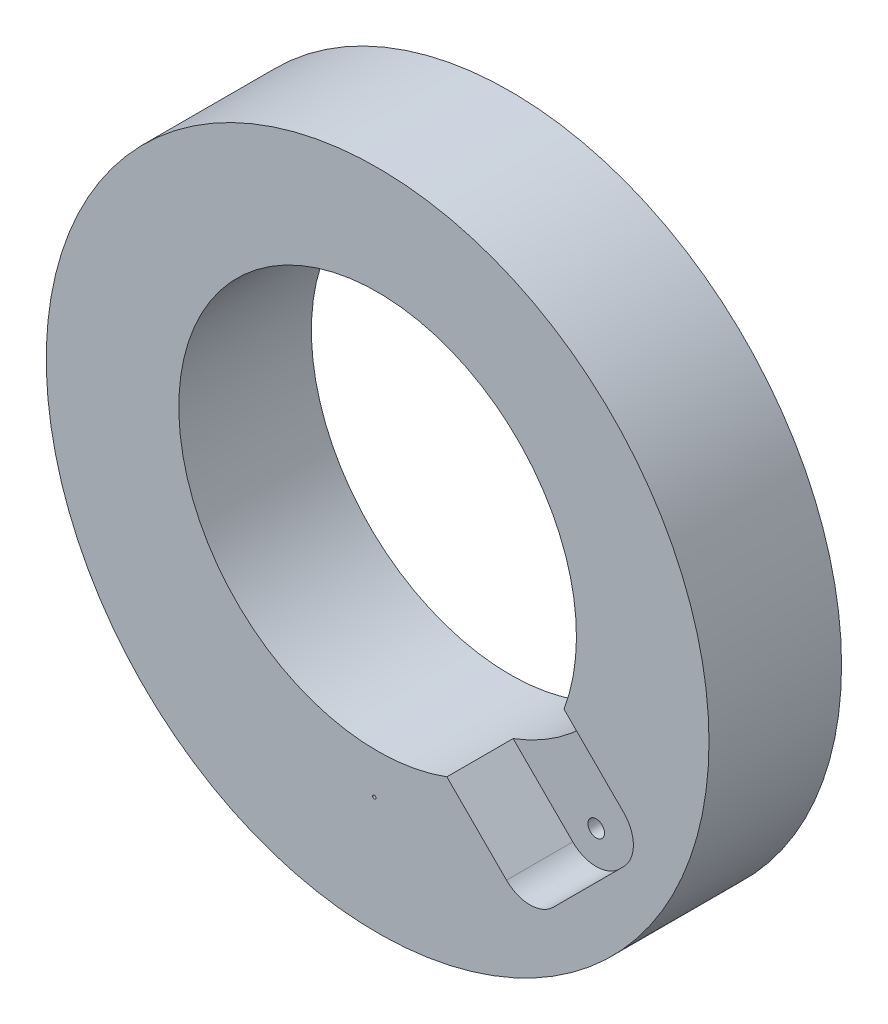
ISO-10303-21;
HEADER;
FILE_DESCRIPTION(('STEP AP214'),'2;1');
FILE_NAME('part.step','',(''),(''),'','','');
FILE_SCHEMA(('AUTOMOTIVE_DESIGN { 1 0 10303 214 1 1 1 1 }'));
ENDSEC;
DATA;
#1=APPLICATION_CONTEXT('core data for automotive mechanical design processes');
#2=APPLICATION_PROTOCOL_DEFINITION('international standard','automotive_design',2000,#1);
#3=PRODUCT_CONTEXT('',#1,'mechanical');
#4=PRODUCT('Part','Part','',(#3));
#5=PRODUCT_RELATED_PRODUCT_CATEGORY('part','',(#4));
#6=PRODUCT_DEFINITION_FORMATION('','',#4);
#7=PRODUCT_DEFINITION_CONTEXT('part definition',#1,'design');
#8=PRODUCT_DEFINITION('design','',#6,#7);
#9=PRODUCT_DEFINITION_SHAPE('','',#8);
#10=(LENGTH_UNIT() NAMED_UNIT(*) SI_UNIT(.MILLI.,.METRE.));
#11=(NAMED_UNIT(*) PLANE_ANGLE_UNIT() SI_UNIT($,.RADIAN.));
#12=(NAMED_UNIT(*) SI_UNIT($,.STERADIAN.) SOLID_ANGLE_UNIT());
#13=UNCERTAINTY_MEASURE_WITH_UNIT(LENGTH_MEASURE(1.E-05),#10,'distance_accuracy_value','');
#14=(GEOMETRIC_REPRESENTATION_CONTEXT(3) GLOBAL_UNCERTAINTY_ASSIGNED_CONTEXT((#13)) GLOBAL_UNIT_ASSIGNED_CONTEXT((#10,
#11,#12)) REPRESENTATION_CONTEXT('',''));
#15=CARTESIAN_POINT('',(0.,0.,0.));
#16=DIRECTION('',(0.,0.,1.));
#17=DIRECTION('',(1.,0.,0.));
#18=AXIS2_PLACEMENT_3D('',#15,#16,#17);
#19=CARTESIAN_POINT('',(0.,0.,40.));
#20=DIRECTION('',(0.,0.,1.));
#21=DIRECTION('',(1.,0.,0.));
#22=AXIS2_PLACEMENT_3D('',#19,#20,#21);
#23=PLANE('',#22);
#24=CARTESIAN_POINT('',(-0.999999999999994,-64.9923072370877,40.));
#25=DIRECTION('',(0.,0.,1.));
#26=DIRECTION('',(1.,0.,0.));
#27=AXIS2_PLACEMENT_3D('',#24,#25,#26);
#28=CIRCLE('',#27,0.499999999999999);
#29=CARTESIAN_POINT('',(-0.499999999999995,-64.9923072370877,40.));
#30=VERTEX_POINT('',#29);
#31=EDGE_CURVE('E106',#30,#30,#28,.T.);
#32=ORIENTED_EDGE('',*,*,#31,.F.);
#33=EDGE_LOOP('',(#32));
#34=FACE_BOUND('',#33,.T.);
#35=DIRECTION('',(0.707106781186544,-0.707106781186551,0.));
#36=VECTOR('',#35,1.);
#37=CARTESIAN_POINT('',(17.272249399292,-45.1275884586198,40.));
#38=LINE('',#37,#36);
#39=CARTESIAN_POINT('',(20.8904520216898,-48.7457910810176,40.));
#40=VERTEX_POINT('',#39);
#41=CARTESIAN_POINT('',(38.8908729652597,-66.7462120245877,40.));
#42=VERTEX_POINT('',#41);
#43=EDGE_CURVE('E117',#40,#42,#38,.T.);
#44=ORIENTED_EDGE('',*,*,#43,.F.);
#45=CARTESIAN_POINT('',(0.,7.5,40.));
#46=DIRECTION('',(0.,0.,1.));
#47=DIRECTION('',(1.,0.,0.));
#48=AXIS2_PLACEMENT_3D('',#45,#46,#47);
#49=CIRCLE('',#48,60.);
#50=CARTESIAN_POINT('',(56.2457910810174,-13.3904520216904,40.));
#51=VERTEX_POINT('',#50);
#52=EDGE_CURVE('E128',#51,#40,#49,.T.);
#53=ORIENTED_EDGE('',*,*,#52,.F.);
#54=DIRECTION('',(-0.707106781186544,0.707106781186551,0.));
#55=VECTOR('',#54,1.);
#56=CARTESIAN_POINT('',(52.6275884586196,-9.7722493992926,40.));
#57=LINE('',#56,#55);
#58=CARTESIAN_POINT('',(74.2462120245873,-31.3908729652605,40.));
#59=VERTEX_POINT('',#58);
#60=EDGE_CURVE('E114',#59,#51,#57,.T.);
#61=ORIENTED_EDGE('',*,*,#60,.F.);
#62=CARTESIAN_POINT('',(67.1751442127218,-38.4619407771259,40.));
#63=DIRECTION('',(0.,0.,1.));
#64=DIRECTION('',(-1.,0.,0.));
#65=AXIS2_PLACEMENT_3D('',#62,#63,#64);
#66=CIRCLE('',#65,10.);
#67=CARTESIAN_POINT('',(74.2462120245872,-45.5330085889914,40.));
#68=VERTEX_POINT('',#67);
#69=EDGE_CURVE('E87',#68,#59,#66,.T.);
#70=ORIENTED_EDGE('',*,*,#69,.F.);
#71=DIRECTION('',(0.707106781186551,0.707106781186544,0.));
#72=VECTOR('',#71,1.);
#73=CARTESIAN_POINT('',(53.0330085889907,-66.7462120245878,40.));
#74=LINE('',#73,#72);
#75=CARTESIAN_POINT('',(53.0330085889907,-66.7462120245878,40.));
#76=VERTEX_POINT('',#75);
#77=EDGE_CURVE('E100',#76,#68,#74,.T.);
#78=ORIENTED_EDGE('',*,*,#77,.F.);
#79=CARTESIAN_POINT('',(45.9619407771252,-59.6751442127223,40.));
#80=DIRECTION('',(0.,0.,1.));
#81=DIRECTION('',(1.,0.,0.));
#82=AXIS2_PLACEMENT_3D('',#79,#80,#81);
#83=CIRCLE('',#82,9.99999999999999);
#84=EDGE_CURVE('E103',#42,#76,#83,.T.);
#85=ORIENTED_EDGE('',*,*,#84,.F.);
#86=EDGE_LOOP('',(#44,#53,#61,#70,#78,#85));
#87=FACE_BOUND('',#86,.T.);
#88=CARTESIAN_POINT('',(0.,0.,40.));
#89=DIRECTION('',(0.,0.,1.));
#90=DIRECTION('',(1.,0.,0.));
#91=AXIS2_PLACEMENT_3D('',#88,#89,#90);
#92=CIRCLE('',#91,100.);
#93=CARTESIAN_POINT('',(100.,0.,40.));
#94=VERTEX_POINT('',#93);
#95=EDGE_CURVE('E134',#94,#94,#92,.T.);
#96=ORIENTED_EDGE('',*,*,#95,.T.);
#97=EDGE_LOOP('',(#96));
#98=FACE_BOUND('',#97,.T.);
#99=ADVANCED_FACE('F30',(#34,#87,#98),#23,.T.);
#100=CARTESIAN_POINT('',(0.,0.,0.));
#101=DIRECTION('',(0.,0.,1.));
#102=DIRECTION('',(1.,0.,0.));
#103=AXIS2_PLACEMENT_3D('',#100,#101,#102);
#104=PLANE('',#103);
#105=CARTESIAN_POINT('',(45.9619407771252,-59.6751442127223,0.));
#106=DIRECTION('',(0.,0.,1.));
#107=DIRECTION('',(1.,0.,0.));
#108=AXIS2_PLACEMENT_3D('',#105,#106,#107);
#109=CIRCLE('',#108,2.5);
#110=CARTESIAN_POINT('',(48.4619407771252,-59.6751442127223,0.));
#111=VERTEX_POINT('',#110);
#112=EDGE_CURVE('E217',#111,#111,#109,.T.);
#113=ORIENTED_EDGE('',*,*,#112,.T.);
#114=EDGE_LOOP('',(#113));
#115=FACE_BOUND('',#114,.T.);
#116=CARTESIAN_POINT('',(67.1751442127218,-38.4619407771259,0.));
#117=DIRECTION('',(0.,0.,1.));
#118=DIRECTION('',(1.,0.,0.));
#119=AXIS2_PLACEMENT_3D('',#116,#117,#118);
#120=CIRCLE('',#119,2.5);
#121=CARTESIAN_POINT('',(69.6751442127218,-38.4619407771259,0.));
#122=VERTEX_POINT('',#121);
#123=EDGE_CURVE('E220',#122,#122,#120,.T.);
#124=ORIENTED_EDGE('',*,*,#123,.T.);
#125=EDGE_LOOP('',(#124));
#126=FACE_BOUND('',#125,.T.);
#127=CARTESIAN_POINT('',(-0.999999999999994,-64.9923072370877,0.));
#128=DIRECTION('',(0.,0.,1.));
#129=DIRECTION('',(1.,0.,0.));
#130=AXIS2_PLACEMENT_3D('',#127,#128,#129);
#131=CIRCLE('',#130,0.499999999999999);
#132=CARTESIAN_POINT('',(-0.499999999999995,-64.9923072370877,0.));
#133=VERTEX_POINT('',#132);
#134=EDGE_CURVE('E115',#133,#133,#131,.T.);
#135=ORIENTED_EDGE('',*,*,#134,.T.);
#136=EDGE_LOOP('',(#135));
#137=FACE_BOUND('',#136,.T.);
#138=CARTESIAN_POINT('',(0.,0.,0.));
#139=DIRECTION('',(0.,0.,1.));
#140=DIRECTION('',(1.,0.,0.));
#141=AXIS2_PLACEMENT_3D('',#138,#139,#140);
#142=CIRCLE('',#141,100.);
#143=CARTESIAN_POINT('',(100.,0.,0.));
#144=VERTEX_POINT('',#143);
#145=EDGE_CURVE('E131',#144,#144,#142,.T.);
#146=ORIENTED_EDGE('',*,*,#145,.F.);
#147=EDGE_LOOP('',(#146));
#148=FACE_BOUND('',#147,.T.);
#149=CARTESIAN_POINT('',(0.,7.5,0.));
#150=DIRECTION('',(0.,0.,1.));
#151=DIRECTION('',(1.,0.,0.));
#152=AXIS2_PLACEMENT_3D('',#149,#150,#151);
#153=CIRCLE('',#152,60.);
#154=CARTESIAN_POINT('',(60.,7.5,0.));
#155=VERTEX_POINT('',#154);
#156=EDGE_CURVE('E123',#155,#155,#153,.T.);
#157=ORIENTED_EDGE('',*,*,#156,.T.);
#158=EDGE_LOOP('',(#157));
#159=FACE_BOUND('',#158,.T.);
#160=ADVANCED_FACE('F142',(#115,#126,#137,#148,#159),#104,.F.);
#161=CARTESIAN_POINT('',(0.,0.,40.));
#162=DIRECTION('',(0.,0.,-1.));
#163=DIRECTION('',(-1.,0.,0.));
#164=AXIS2_PLACEMENT_3D('',#161,#162,#163);
#165=CYLINDRICAL_SURFACE('',#164,100.);
#166=ORIENTED_EDGE('',*,*,#95,.F.);
#167=EDGE_LOOP('',(#166));
#168=FACE_BOUND('',#167,.T.);
#169=ORIENTED_EDGE('',*,*,#145,.T.);
#170=EDGE_LOOP('',(#169));
#171=FACE_BOUND('',#170,.T.);
#172=ADVANCED_FACE('F32',(#168,#171),#165,.T.);
#173=CARTESIAN_POINT('',(0.,7.5,40.));
#174=DIRECTION('',(0.,0.,-1.));
#175=DIRECTION('',(-1.,0.,0.));
#176=AXIS2_PLACEMENT_3D('',#173,#174,#175);
#177=CYLINDRICAL_SURFACE('',#176,60.);
#178=DIRECTION('',(0.,0.,-1.));
#179=VECTOR('',#178,1.);
#180=CARTESIAN_POINT('',(20.8904520216898,-48.7457910810176,40.));
#181=LINE('',#180,#179);
#182=CARTESIAN_POINT('',(20.8904520216898,-48.7457910810176,20.));
#183=VERTEX_POINT('',#182);
#184=EDGE_CURVE('E11',#183,#40,#181,.F.);
#185=ORIENTED_EDGE('',*,*,#184,.F.);
#186=CARTESIAN_POINT('',(0.,7.5,20.));
#187=DIRECTION('',(0.,0.,-1.));
#188=DIRECTION('',(-1.,0.,0.));
#189=AXIS2_PLACEMENT_3D('',#186,#187,#188);
#190=CIRCLE('',#189,60.);
#191=CARTESIAN_POINT('',(56.2457910810174,-13.3904520216904,20.));
#192=VERTEX_POINT('',#191);
#193=EDGE_CURVE('E50',#192,#183,#190,.T.);
#194=ORIENTED_EDGE('',*,*,#193,.F.);
#195=DIRECTION('',(0.,0.,-1.));
#196=VECTOR('',#195,1.);
#197=CARTESIAN_POINT('',(56.2457910810174,-13.3904520216904,40.));
#198=LINE('',#197,#196);
#199=EDGE_CURVE('E38',#51,#192,#198,.T.);
#200=ORIENTED_EDGE('',*,*,#199,.F.);
#201=ORIENTED_EDGE('',*,*,#52,.T.);
#202=EDGE_LOOP('',(#185,#194,#200,#201));
#203=FACE_BOUND('',#202,.T.);
#204=ORIENTED_EDGE('',*,*,#156,.F.);
#205=EDGE_LOOP('',(#204));
#206=FACE_BOUND('',#205,.T.);
#207=ADVANCED_FACE('F148',(#203,#206),#177,.F.);
#208=CARTESIAN_POINT('',(67.1751442127218,-38.4619407771259,20.));
#209=DIRECTION('',(0.,0.,1.));
#210=DIRECTION('',(1.,0.,0.));
#211=AXIS2_PLACEMENT_3D('',#208,#209,#210);
#212=CYLINDRICAL_SURFACE('',#211,10.);
#213=ORIENTED_EDGE('',*,*,#69,.T.);
#214=DIRECTION('',(0.,0.,1.));
#215=VECTOR('',#214,1.);
#216=CARTESIAN_POINT('',(74.2462120245873,-31.3908729652605,20.));
#217=LINE('',#216,#215);
#218=CARTESIAN_POINT('',(74.2462120245873,-31.3908729652605,20.));
#219=VERTEX_POINT('',#218);
#220=EDGE_CURVE('E82',#219,#59,#217,.T.);
#221=ORIENTED_EDGE('',*,*,#220,.F.);
#222=CARTESIAN_POINT('',(67.1751442127218,-38.4619407771259,20.));
#223=DIRECTION('',(0.,0.,1.));
#224=DIRECTION('',(-1.,0.,0.));
#225=AXIS2_PLACEMENT_3D('',#222,#223,#224);
#226=CIRCLE('',#225,10.);
#227=CARTESIAN_POINT('',(74.2462120245872,-45.5330085889914,20.));
#228=VERTEX_POINT('',#227);
#229=EDGE_CURVE('E84',#228,#219,#226,.T.);
#230=ORIENTED_EDGE('',*,*,#229,.F.);
#231=DIRECTION('',(0.,0.,1.));
#232=VECTOR('',#231,1.);
#233=CARTESIAN_POINT('',(74.2462120245872,-45.5330085889914,20.));
#234=LINE('',#233,#232);
#235=EDGE_CURVE('E121',#228,#68,#234,.T.);
#236=ORIENTED_EDGE('',*,*,#235,.T.);
#237=EDGE_LOOP('',(#213,#221,#230,#236));
#238=FACE_BOUND('',#237,.T.);
#239=ADVANCED_FACE('F83',(#238),#212,.F.);
#240=CARTESIAN_POINT('',(53.0330085889907,-66.7462120245878,20.));
#241=DIRECTION('',(0.707106781186544,-0.707106781186551,0.));
#242=DIRECTION('',(0.707106781186551,0.707106781186544,0.));
#243=AXIS2_PLACEMENT_3D('',#240,#241,#242);
#244=PLANE('',#243);
#245=ORIENTED_EDGE('',*,*,#77,.T.);
#246=ORIENTED_EDGE('',*,*,#235,.F.);
#247=DIRECTION('',(0.707106781186551,0.707106781186544,0.));
#248=VECTOR('',#247,1.);
#249=CARTESIAN_POINT('',(53.0330085889907,-66.7462120245878,20.));
#250=LINE('',#249,#248);
#251=CARTESIAN_POINT('',(53.0330085889907,-66.7462120245878,20.));
#252=VERTEX_POINT('',#251);
#253=EDGE_CURVE('E91',#252,#228,#250,.T.);
#254=ORIENTED_EDGE('',*,*,#253,.F.);
#255=DIRECTION('',(0.,0.,1.));
#256=VECTOR('',#255,1.);
#257=CARTESIAN_POINT('',(53.0330085889907,-66.7462120245878,20.));
#258=LINE('',#257,#256);
#259=EDGE_CURVE('E124',#252,#76,#258,.T.);
#260=ORIENTED_EDGE('',*,*,#259,.T.);
#261=EDGE_LOOP('',(#245,#246,#254,#260));
#262=FACE_BOUND('',#261,.T.);
#263=ADVANCED_FACE('F156',(#262),#244,.F.);
#264=CARTESIAN_POINT('',(45.9619407771252,-59.6751442127223,20.));
#265=DIRECTION('',(0.,0.,1.));
#266=DIRECTION('',(1.,0.,0.));
#267=AXIS2_PLACEMENT_3D('',#264,#265,#266);
#268=CYLINDRICAL_SURFACE('',#267,9.99999999999999);
#269=ORIENTED_EDGE('',*,*,#84,.T.);
#270=ORIENTED_EDGE('',*,*,#259,.F.);
#271=CARTESIAN_POINT('',(45.9619407771252,-59.6751442127223,20.));
#272=DIRECTION('',(0.,0.,1.));
#273=DIRECTION('',(1.,0.,0.));
#274=AXIS2_PLACEMENT_3D('',#271,#272,#273);
#275=CIRCLE('',#274,9.99999999999999);
#276=CARTESIAN_POINT('',(38.8908729652597,-66.7462120245877,20.));
#277=VERTEX_POINT('',#276);
#278=EDGE_CURVE('E110',#277,#252,#275,.T.);
#279=ORIENTED_EDGE('',*,*,#278,.F.);
#280=DIRECTION('',(0.,0.,1.));
#281=VECTOR('',#280,1.);
#282=CARTESIAN_POINT('',(38.8908729652597,-66.7462120245877,20.));
#283=LINE('',#282,#281);
#284=EDGE_CURVE('E90',#277,#42,#283,.T.);
#285=ORIENTED_EDGE('',*,*,#284,.T.);
#286=EDGE_LOOP('',(#269,#270,#279,#285));
#287=FACE_BOUND('',#286,.T.);
#288=ADVANCED_FACE('F180',(#287),#268,.F.);
#289=CARTESIAN_POINT('',(17.272249399292,-45.1275884586198,20.));
#290=DIRECTION('',(-0.707106781186551,-0.707106781186544,0.));
#291=DIRECTION('',(0.707106781186544,-0.707106781186551,0.));
#292=AXIS2_PLACEMENT_3D('',#289,#290,#291);
#293=PLANE('',#292);
#294=ORIENTED_EDGE('',*,*,#184,.T.);
#295=ORIENTED_EDGE('',*,*,#43,.T.);
#296=ORIENTED_EDGE('',*,*,#284,.F.);
#297=DIRECTION('',(0.707106781186544,-0.707106781186551,0.));
#298=VECTOR('',#297,1.);
#299=CARTESIAN_POINT('',(17.272249399292,-45.1275884586198,20.));
#300=LINE('',#299,#298);
#301=EDGE_CURVE('E95',#183,#277,#300,.T.);
#302=ORIENTED_EDGE('',*,*,#301,.F.);
#303=EDGE_LOOP('',(#294,#295,#296,#302));
#304=FACE_BOUND('',#303,.T.);
#305=ADVANCED_FACE('F176',(#304),#293,.F.);
#306=CARTESIAN_POINT('',(52.6275884586196,-9.7722493992926,20.));
#307=DIRECTION('',(0.707106781186551,0.707106781186544,0.));
#308=DIRECTION('',(-0.707106781186544,0.707106781186551,0.));
#309=AXIS2_PLACEMENT_3D('',#306,#307,#308);
#310=PLANE('',#309);
#311=ORIENTED_EDGE('',*,*,#199,.T.);
#312=DIRECTION('',(-0.707106781186544,0.707106781186551,0.));
#313=VECTOR('',#312,1.);
#314=CARTESIAN_POINT('',(52.6275884586196,-9.7722493992926,20.));
#315=LINE('',#314,#313);
#316=EDGE_CURVE('E45',#219,#192,#315,.T.);
#317=ORIENTED_EDGE('',*,*,#316,.F.);
#318=ORIENTED_EDGE('',*,*,#220,.T.);
#319=ORIENTED_EDGE('',*,*,#60,.T.);
#320=EDGE_LOOP('',(#311,#317,#318,#319));
#321=FACE_BOUND('',#320,.T.);
#322=ADVANCED_FACE('F93',(#321),#310,.F.);
#323=CARTESIAN_POINT('',(67.1751442127218,-38.4619407771259,20.));
#324=DIRECTION('',(0.,0.,-1.));
#325=DIRECTION('',(-1.,0.,0.));
#326=AXIS2_PLACEMENT_3D('',#323,#324,#325);
#327=PLANE('',#326);
#328=CARTESIAN_POINT('',(45.9619407771252,-59.6751442127223,20.));
#329=DIRECTION('',(0.,0.,1.));
#330=DIRECTION('',(1.,0.,0.));
#331=AXIS2_PLACEMENT_3D('',#328,#329,#330);
#332=CIRCLE('',#331,2.49999999999999);
#333=CARTESIAN_POINT('',(48.4619407771252,-59.6751442127223,20.));
#334=VERTEX_POINT('',#333);
#335=EDGE_CURVE('E219',#334,#334,#332,.T.);
#336=ORIENTED_EDGE('',*,*,#335,.F.);
#337=EDGE_LOOP('',(#336));
#338=FACE_BOUND('',#337,.T.);
#339=CARTESIAN_POINT('',(67.1751442127218,-38.4619407771259,20.));
#340=DIRECTION('',(0.,0.,1.));
#341=DIRECTION('',(1.,0.,0.));
#342=AXIS2_PLACEMENT_3D('',#339,#340,#341);
#343=CIRCLE('',#342,2.49999999999999);
#344=CARTESIAN_POINT('',(69.6751442127218,-38.4619407771259,20.));
#345=VERTEX_POINT('',#344);
#346=EDGE_CURVE('E223',#345,#345,#343,.T.);
#347=ORIENTED_EDGE('',*,*,#346,.F.);
#348=EDGE_LOOP('',(#347));
#349=FACE_BOUND('',#348,.T.);
#350=ORIENTED_EDGE('',*,*,#193,.T.);
#351=ORIENTED_EDGE('',*,*,#301,.T.);
#352=ORIENTED_EDGE('',*,*,#278,.T.);
#353=ORIENTED_EDGE('',*,*,#253,.T.);
#354=ORIENTED_EDGE('',*,*,#229,.T.);
#355=ORIENTED_EDGE('',*,*,#316,.T.);
#356=EDGE_LOOP('',(#350,#351,#352,#353,#354,#355));
#357=FACE_BOUND('',#356,.T.);
#358=ADVANCED_FACE('F97',(#338,#349,#357),#327,.F.);
#359=CARTESIAN_POINT('',(-0.999999999999994,-64.9923072370877,0.));
#360=DIRECTION('',(0.,0.,1.));
#361=DIRECTION('',(1.,0.,0.));
#362=AXIS2_PLACEMENT_3D('',#359,#360,#361);
#363=CYLINDRICAL_SURFACE('',#362,0.499999999999999);
#364=ORIENTED_EDGE('',*,*,#134,.F.);
#365=EDGE_LOOP('',(#364));
#366=FACE_BOUND('',#365,.T.);
#367=ORIENTED_EDGE('',*,*,#31,.T.);
#368=EDGE_LOOP('',(#367));
#369=FACE_BOUND('',#368,.T.);
#370=ADVANCED_FACE('F195',(#366,#369),#363,.F.);
#371=CARTESIAN_POINT('',(67.1751442127218,-38.4619407771259,20.));
#372=DIRECTION('',(0.,0.,1.));
#373=DIRECTION('',(1.,0.,0.));
#374=AXIS2_PLACEMENT_3D('',#371,#372,#373);
#375=CYLINDRICAL_SURFACE('',#374,2.5);
#376=ORIENTED_EDGE('',*,*,#123,.F.);
#377=EDGE_LOOP('',(#376));
#378=FACE_BOUND('',#377,.T.);
#379=ORIENTED_EDGE('',*,*,#346,.T.);
#380=EDGE_LOOP('',(#379));
#381=FACE_BOUND('',#380,.T.);
#382=ADVANCED_FACE('F200',(#378,#381),#375,.F.);
#383=CARTESIAN_POINT('',(45.9619407771252,-59.6751442127223,20.));
#384=DIRECTION('',(0.,0.,1.));
#385=DIRECTION('',(1.,0.,0.));
#386=AXIS2_PLACEMENT_3D('',#383,#384,#385);
#387=CYLINDRICAL_SURFACE('',#386,2.49999999999999);
#388=ORIENTED_EDGE('',*,*,#112,.F.);
#389=EDGE_LOOP('',(#388));
#390=FACE_BOUND('',#389,.T.);
#391=ORIENTED_EDGE('',*,*,#335,.T.);
#392=EDGE_LOOP('',(#391));
#393=FACE_BOUND('',#392,.T.);
#394=ADVANCED_FACE('F208',(#390,#393),#387,.F.);
#395=CLOSED_SHELL('',(#99,#160,#172,#207,#239,#263,#288,#305,#322,#358,#370,#382,#394));
#396=MANIFOLD_SOLID_BREP('B2',#395);
#397=ADVANCED_BREP_SHAPE_REPRESENTATION('',(#18,#396),#14);
#398=SHAPE_DEFINITION_REPRESENTATION(#9,#397);
ENDSEC;
END-ISO-10303-21;
